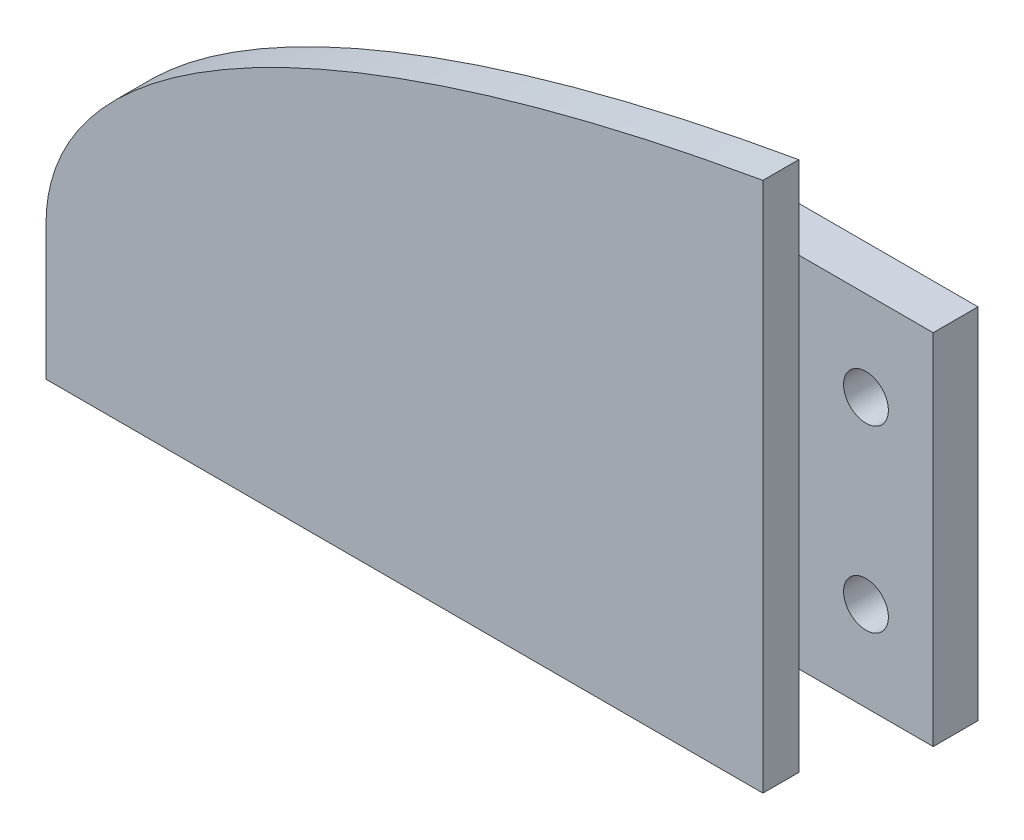
ISO-10303-21;
HEADER;
FILE_DESCRIPTION(('STEP AP214'),'2;1');
FILE_NAME('part.step','',(''),(''),'','','');
FILE_SCHEMA(('AUTOMOTIVE_DESIGN { 1 0 10303 214 1 1 1 1 }'));
ENDSEC;
DATA;
#1=APPLICATION_CONTEXT('core data for automotive mechanical design processes');
#2=APPLICATION_PROTOCOL_DEFINITION('international standard','automotive_design',2000,#1);
#3=PRODUCT_CONTEXT('',#1,'mechanical');
#4=PRODUCT('Part','Part','',(#3));
#5=PRODUCT_RELATED_PRODUCT_CATEGORY('part','',(#4));
#6=PRODUCT_DEFINITION_FORMATION('','',#4);
#7=PRODUCT_DEFINITION_CONTEXT('part definition',#1,'design');
#8=PRODUCT_DEFINITION('design','',#6,#7);
#9=PRODUCT_DEFINITION_SHAPE('','',#8);
#10=(LENGTH_UNIT() NAMED_UNIT(*) SI_UNIT(.MILLI.,.METRE.));
#11=(NAMED_UNIT(*) PLANE_ANGLE_UNIT() SI_UNIT($,.RADIAN.));
#12=(NAMED_UNIT(*) SI_UNIT($,.STERADIAN.) SOLID_ANGLE_UNIT());
#13=UNCERTAINTY_MEASURE_WITH_UNIT(LENGTH_MEASURE(1.E-05),#10,'distance_accuracy_value','');
#14=(GEOMETRIC_REPRESENTATION_CONTEXT(3) GLOBAL_UNCERTAINTY_ASSIGNED_CONTEXT((#13)) GLOBAL_UNIT_ASSIGNED_CONTEXT((#10,
#11,#12)) REPRESENTATION_CONTEXT('',''));
#15=CARTESIAN_POINT('',(0.,0.,0.));
#16=DIRECTION('',(0.,0.,1.));
#17=DIRECTION('',(1.,0.,0.));
#18=AXIS2_PLACEMENT_3D('',#15,#16,#17);
#19=CARTESIAN_POINT('',(0.,0.,0.));
#20=DIRECTION('',(0.,0.,1.));
#21=DIRECTION('',(1.,0.,0.));
#22=AXIS2_PLACEMENT_3D('',#19,#20,#21);
#23=PLANE('',#22);
#24=DIRECTION('',(1.,0.,0.));
#25=VECTOR('',#24,1.);
#26=CARTESIAN_POINT('',(-85.,35.,0.));
#27=LINE('',#26,#25);
#28=CARTESIAN_POINT('',(-85.,35.,0.));
#29=VERTEX_POINT('',#28);
#30=CARTESIAN_POINT('',(-70.,35.,0.));
#31=VERTEX_POINT('',#30);
#32=EDGE_CURVE('E50',#29,#31,#27,.T.);
#33=ORIENTED_EDGE('',*,*,#32,.F.);
#34=DIRECTION('',(0.,1.,0.));
#35=VECTOR('',#34,1.);
#36=CARTESIAN_POINT('',(-85.,-5.,0.));
#37=LINE('',#36,#35);
#38=CARTESIAN_POINT('',(-85.,-5.,0.));
#39=VERTEX_POINT('',#38);
#40=EDGE_CURVE('E195',#39,#29,#37,.T.);
#41=ORIENTED_EDGE('',*,*,#40,.F.);
#42=DIRECTION('',(-1.,0.,0.));
#43=VECTOR('',#42,1.);
#44=CARTESIAN_POINT('',(0.,-5.,0.));
#45=LINE('',#44,#43);
#46=CARTESIAN_POINT('',(-70.,-5.,0.));
#47=VERTEX_POINT('',#46);
#48=EDGE_CURVE('E11',#47,#39,#45,.T.);
#49=ORIENTED_EDGE('',*,*,#48,.F.);
#50=DIRECTION('',(0.,-1.,0.));
#51=VECTOR('',#50,1.);
#52=CARTESIAN_POINT('',(-70.,0.,0.));
#53=LINE('',#52,#51);
#54=CARTESIAN_POINT('',(-70.,-15.,0.));
#55=VERTEX_POINT('',#54);
#56=EDGE_CURVE('E446',#47,#55,#53,.T.);
#57=ORIENTED_EDGE('',*,*,#56,.T.);
#58=DIRECTION('',(1.,0.,0.));
#59=VECTOR('',#58,1.);
#60=CARTESIAN_POINT('',(-150.,-15.,0.));
#61=LINE('',#60,#59);
#62=CARTESIAN_POINT('',(-86.9999999999999,-15.,0.));
#63=VERTEX_POINT('',#62);
#64=EDGE_CURVE('E268',#63,#55,#61,.T.);
#65=ORIENTED_EDGE('',*,*,#64,.F.);
#66=DIRECTION('',(0.,1.,0.));
#67=VECTOR('',#66,1.);
#68=CARTESIAN_POINT('',(-86.9999999999999,-2.51983106480912,0.));
#69=LINE('',#68,#67);
#70=CARTESIAN_POINT('',(-86.9999999999999,-2.51983106480913,0.));
#71=VERTEX_POINT('',#70);
#72=EDGE_CURVE('E285',#63,#71,#69,.T.);
#73=ORIENTED_EDGE('',*,*,#72,.T.);
#74=DIRECTION('',(1.,0.,0.));
#75=VECTOR('',#74,1.);
#76=CARTESIAN_POINT('',(-90.,-2.51983106480913,0.));
#77=LINE('',#76,#75);
#78=CARTESIAN_POINT('',(-112.,-2.51983106480913,0.));
#79=VERTEX_POINT('',#78);
#80=EDGE_CURVE('E241',#79,#71,#77,.T.);
#81=ORIENTED_EDGE('',*,*,#80,.F.);
#82=CARTESIAN_POINT('',(-138.,-2.51983106480913,0.));
#83=VERTEX_POINT('',#82);
#84=EDGE_CURVE('E246',#83,#79,#77,.T.);
#85=ORIENTED_EDGE('',*,*,#84,.F.);
#86=DIRECTION('',(0.,-1.,0.));
#87=VECTOR('',#86,1.);
#88=CARTESIAN_POINT('',(-138.,-15.,0.));
#89=LINE('',#88,#87);
#90=CARTESIAN_POINT('',(-138.,-15.,0.));
#91=VERTEX_POINT('',#90);
#92=EDGE_CURVE('E468',#83,#91,#89,.T.);
#93=ORIENTED_EDGE('',*,*,#92,.T.);
#94=CARTESIAN_POINT('',(-150.,-15.,0.));
#95=VERTEX_POINT('',#94);
#96=EDGE_CURVE('E278',#95,#91,#61,.T.);
#97=ORIENTED_EDGE('',*,*,#96,.F.);
#98=DIRECTION('',(0.,1.,0.));
#99=VECTOR('',#98,1.);
#100=CARTESIAN_POINT('',(-150.,-15.,0.));
#101=LINE('',#100,#99);
#102=CARTESIAN_POINT('',(-150.,0.,0.));
#103=VERTEX_POINT('',#102);
#104=EDGE_CURVE('E512',#95,#103,#101,.T.);
#105=ORIENTED_EDGE('',*,*,#104,.T.);
#106=CARTESIAN_POINT('',(0.,0.,0.));
#107=DIRECTION('',(0.,0.,1.));
#108=DIRECTION('',(1.,0.,0.));
#109=AXIS2_PLACEMENT_3D('',#106,#107,#108);
#110=ELLIPSE('',#109,150.,50.);
#111=CARTESIAN_POINT('',(-70.,44.2216638714053,0.));
#112=VERTEX_POINT('',#111);
#113=EDGE_CURVE('E281',#112,#103,#110,.T.);
#114=ORIENTED_EDGE('',*,*,#113,.F.);
#115=EDGE_CURVE('E445',#112,#31,#53,.T.);
#116=ORIENTED_EDGE('',*,*,#115,.T.);
#117=EDGE_LOOP('',(#33,#41,#49,#57,#65,#73,#81,#85,#93,#97,#105,#114,#116));
#118=FACE_BOUND('',#117,.T.);
#119=ADVANCED_FACE('F35',(#118),#23,.F.);
#120=CARTESIAN_POINT('',(-70.,0.,0.));
#121=DIRECTION('',(-1.,0.,0.));
#122=DIRECTION('',(0.,-1.,0.));
#123=AXIS2_PLACEMENT_3D('',#120,#121,#122);
#124=PLANE('',#123);
#125=DIRECTION('',(0.,0.,-1.));
#126=VECTOR('',#125,1.);
#127=CARTESIAN_POINT('',(-70.,44.2216638714053,4.));
#128=LINE('',#127,#126);
#129=CARTESIAN_POINT('',(-70.,44.2216638714053,4.));
#130=VERTEX_POINT('',#129);
#131=EDGE_CURVE('E448',#130,#112,#128,.T.);
#132=ORIENTED_EDGE('',*,*,#131,.F.);
#133=DIRECTION('',(0.,-1.,0.));
#134=VECTOR('',#133,1.);
#135=CARTESIAN_POINT('',(-70.,0.,4.));
#136=LINE('',#135,#134);
#137=CARTESIAN_POINT('',(-70.,-15.,4.));
#138=VERTEX_POINT('',#137);
#139=EDGE_CURVE('E447',#130,#138,#136,.T.);
#140=ORIENTED_EDGE('',*,*,#139,.T.);
#141=DIRECTION('',(0.,0.,-1.));
#142=VECTOR('',#141,1.);
#143=CARTESIAN_POINT('',(-70.,-15.,0.));
#144=LINE('',#143,#142);
#145=EDGE_CURVE('E43',#138,#55,#144,.T.);
#146=ORIENTED_EDGE('',*,*,#145,.T.);
#147=ORIENTED_EDGE('',*,*,#56,.F.);
#148=EDGE_CURVE('E425',#31,#47,#53,.T.);
#149=ORIENTED_EDGE('',*,*,#148,.F.);
#150=ORIENTED_EDGE('',*,*,#115,.F.);
#151=EDGE_LOOP('',(#132,#140,#146,#147,#149,#150));
#152=FACE_BOUND('',#151,.T.);
#153=ADVANCED_FACE('F37',(#152),#124,.F.);
#154=CARTESIAN_POINT('',(-115.,-2.51983106480913,-10.));
#155=DIRECTION('',(0.,-1.,0.));
#156=DIRECTION('',(0.,0.,-1.));
#157=AXIS2_PLACEMENT_3D('',#154,#155,#156);
#158=PLANE('',#157);
#159=CARTESIAN_POINT('',(-125.,-2.51983106480913,-5.));
#160=DIRECTION('',(0.,1.,0.));
#161=DIRECTION('',(0.,0.,1.));
#162=AXIS2_PLACEMENT_3D('',#159,#160,#161);
#163=CIRCLE('',#162,2.5);
#164=CARTESIAN_POINT('',(-125.,-2.51983106480913,-2.50000000000001));
#165=VERTEX_POINT('',#164);
#166=EDGE_CURVE('E196',#165,#165,#163,.T.);
#167=ORIENTED_EDGE('',*,*,#166,.F.);
#168=EDGE_LOOP('',(#167));
#169=FACE_BOUND('',#168,.T.);
#170=DIRECTION('',(0.707106781186544,0.,-0.707106781186551));
#171=VECTOR('',#170,1.);
#172=CARTESIAN_POINT('',(-121.5,-2.51983106480913,-16.5000000000001));
#173=LINE('',#172,#171);
#174=CARTESIAN_POINT('',(-135.,-2.51983106480913,-3.00000000000003));
#175=VERTEX_POINT('',#174);
#176=EDGE_CURVE('E458',#175,#83,#173,.F.);
#177=ORIENTED_EDGE('',*,*,#176,.T.);
#178=ORIENTED_EDGE('',*,*,#84,.T.);
#179=DIRECTION('',(-0.707106781186544,0.,-0.707106781186551));
#180=VECTOR('',#179,1.);
#181=CARTESIAN_POINT('',(-115.,-2.51983106480913,-3.00000000000004));
#182=LINE('',#181,#180);
#183=CARTESIAN_POINT('',(-112.5,-2.51983106480913,-0.500000000000027));
#184=VERTEX_POINT('',#183);
#185=EDGE_CURVE('E470',#184,#79,#182,.F.);
#186=ORIENTED_EDGE('',*,*,#185,.F.);
#187=DIRECTION('',(0.707106781186544,0.,0.707106781186551));
#188=VECTOR('',#187,1.);
#189=CARTESIAN_POINT('',(-118.5,-2.51983106480913,-6.50000000000006));
#190=LINE('',#189,#188);
#191=CARTESIAN_POINT('',(-115.,-2.51983106480913,-3.00000000000005));
#192=VERTEX_POINT('',#191);
#193=EDGE_CURVE('E461',#184,#192,#190,.F.);
#194=ORIENTED_EDGE('',*,*,#193,.T.);
#195=DIRECTION('',(0.,0.,1.));
#196=VECTOR('',#195,1.);
#197=CARTESIAN_POINT('',(-115.,-2.51983106480913,-10.));
#198=LINE('',#197,#196);
#199=CARTESIAN_POINT('',(-115.,-2.51983106480913,-10.));
#200=VERTEX_POINT('',#199);
#201=EDGE_CURVE('E223',#200,#192,#198,.T.);
#202=ORIENTED_EDGE('',*,*,#201,.F.);
#203=DIRECTION('',(1.,0.,0.));
#204=VECTOR('',#203,1.);
#205=CARTESIAN_POINT('',(-115.,-2.51983106480913,-10.));
#206=LINE('',#205,#204);
#207=CARTESIAN_POINT('',(-135.,-2.51983106480913,-10.));
#208=VERTEX_POINT('',#207);
#209=EDGE_CURVE('E221',#208,#200,#206,.T.);
#210=ORIENTED_EDGE('',*,*,#209,.F.);
#211=DIRECTION('',(0.,0.,1.));
#212=VECTOR('',#211,1.);
#213=CARTESIAN_POINT('',(-135.,-2.51983106480913,-10.));
#214=LINE('',#213,#212);
#215=EDGE_CURVE('E226',#208,#175,#214,.T.);
#216=ORIENTED_EDGE('',*,*,#215,.T.);
#217=EDGE_LOOP('',(#177,#178,#186,#194,#202,#210,#216));
#218=FACE_BOUND('',#217,.T.);
#219=ADVANCED_FACE('F344',(#169,#218),#158,.F.);
#220=CARTESIAN_POINT('',(-90.,-2.51983106480913,-10.));
#221=DIRECTION('',(0.,-1.,0.));
#222=DIRECTION('',(0.,0.,-1.));
#223=AXIS2_PLACEMENT_3D('',#220,#221,#222);
#224=PLANE('',#223);
#225=CARTESIAN_POINT('',(-100.,-2.51983106480913,-5.));
#226=DIRECTION('',(0.,1.,0.));
#227=DIRECTION('',(0.,0.,1.));
#228=AXIS2_PLACEMENT_3D('',#225,#226,#227);
#229=CIRCLE('',#228,2.5);
#230=CARTESIAN_POINT('',(-100.,-2.51983106480913,-2.50000000000001));
#231=VERTEX_POINT('',#230);
#232=EDGE_CURVE('E235',#231,#231,#229,.T.);
#233=ORIENTED_EDGE('',*,*,#232,.F.);
#234=EDGE_LOOP('',(#233));
#235=FACE_BOUND('',#234,.T.);
#236=DIRECTION('',(0.707106781186544,0.,-0.707106781186551));
#237=VECTOR('',#236,1.);
#238=CARTESIAN_POINT('',(-96.5000000000001,-2.51983106480913,-16.5));
#239=LINE('',#238,#237);
#240=CARTESIAN_POINT('',(-110.,-2.51983106480913,-3.00000000000003));
#241=VERTEX_POINT('',#240);
#242=EDGE_CURVE('E481',#241,#184,#239,.F.);
#243=ORIENTED_EDGE('',*,*,#242,.T.);
#244=ORIENTED_EDGE('',*,*,#185,.T.);
#245=ORIENTED_EDGE('',*,*,#80,.T.);
#246=DIRECTION('',(0.707106781186545,0.,0.70710678118655));
#247=VECTOR('',#246,1.);
#248=CARTESIAN_POINT('',(-93.5,-2.51983106480913,-6.50000000000007));
#249=LINE('',#248,#247);
#250=CARTESIAN_POINT('',(-90.,-2.51983106480913,-3.00000000000009));
#251=VERTEX_POINT('',#250);
#252=EDGE_CURVE('E484',#71,#251,#249,.F.);
#253=ORIENTED_EDGE('',*,*,#252,.T.);
#254=DIRECTION('',(0.,0.,1.));
#255=VECTOR('',#254,1.);
#256=CARTESIAN_POINT('',(-90.,-2.51983106480913,-10.));
#257=LINE('',#256,#255);
#258=CARTESIAN_POINT('',(-90.,-2.51983106480913,-10.));
#259=VERTEX_POINT('',#258);
#260=EDGE_CURVE('E252',#259,#251,#257,.T.);
#261=ORIENTED_EDGE('',*,*,#260,.F.);
#262=DIRECTION('',(1.,0.,0.));
#263=VECTOR('',#262,1.);
#264=CARTESIAN_POINT('',(-90.,-2.51983106480913,-10.));
#265=LINE('',#264,#263);
#266=CARTESIAN_POINT('',(-110.,-2.51983106480913,-10.));
#267=VERTEX_POINT('',#266);
#268=EDGE_CURVE('E250',#267,#259,#265,.T.);
#269=ORIENTED_EDGE('',*,*,#268,.F.);
#270=DIRECTION('',(0.,0.,1.));
#271=VECTOR('',#270,1.);
#272=CARTESIAN_POINT('',(-110.,-2.51983106480913,-10.));
#273=LINE('',#272,#271);
#274=EDGE_CURVE('E256',#267,#241,#273,.T.);
#275=ORIENTED_EDGE('',*,*,#274,.T.);
#276=EDGE_LOOP('',(#243,#244,#245,#253,#261,#269,#275));
#277=FACE_BOUND('',#276,.T.);
#278=ADVANCED_FACE('F306',(#235,#277),#224,.F.);
#279=CARTESIAN_POINT('',(0.,0.,4.));
#280=DIRECTION('',(0.,0.,1.));
#281=DIRECTION('',(1.,0.,0.));
#282=AXIS2_PLACEMENT_3D('',#279,#280,#281);
#283=ELLIPSE('',#282,150.,50.);
#284=DIRECTION('',(0.,0.,-1.));
#285=VECTOR('',#284,1.);
#286=SURFACE_OF_LINEAR_EXTRUSION('',#283,#285);
#287=CARTESIAN_POINT('',(-150.,0.,4.));
#288=VERTEX_POINT('',#287);
#289=EDGE_CURVE('E286',#130,#288,#283,.T.);
#290=ORIENTED_EDGE('',*,*,#289,.F.);
#291=ORIENTED_EDGE('',*,*,#131,.T.);
#292=ORIENTED_EDGE('',*,*,#113,.T.);
#293=DIRECTION('',(0.,0.,-1.));
#294=VECTOR('',#293,1.);
#295=CARTESIAN_POINT('',(-150.,0.,4.));
#296=LINE('',#295,#294);
#297=EDGE_CURVE('E296',#103,#288,#296,.F.);
#298=ORIENTED_EDGE('',*,*,#297,.T.);
#299=EDGE_LOOP('',(#290,#291,#292,#298));
#300=FACE_BOUND('',#299,.T.);
#301=ADVANCED_FACE('F301',(#300),#286,.F.);
#302=CARTESIAN_POINT('',(-100.,-22.0710678118655,-5.));
#303=DIRECTION('',(0.,1.,0.));
#304=DIRECTION('',(0.,0.,1.));
#305=AXIS2_PLACEMENT_3D('',#302,#303,#304);
#306=CYLINDRICAL_SURFACE('',#305,2.5);
#307=ORIENTED_EDGE('',*,*,#232,.T.);
#308=EDGE_LOOP('',(#307));
#309=FACE_BOUND('',#308,.T.);
#310=CARTESIAN_POINT('',(-100.,-15.,-5.));
#311=DIRECTION('',(0.,-1.,0.));
#312=DIRECTION('',(0.,0.,-1.));
#313=AXIS2_PLACEMENT_3D('',#310,#311,#312);
#314=CIRCLE('',#313,2.5);
#315=CARTESIAN_POINT('',(-100.,-15.,-7.5));
#316=VERTEX_POINT('',#315);
#317=EDGE_CURVE('E238',#316,#316,#314,.F.);
#318=ORIENTED_EDGE('',*,*,#317,.F.);
#319=EDGE_LOOP('',(#318));
#320=FACE_BOUND('',#319,.T.);
#321=ADVANCED_FACE('F305',(#309,#320),#306,.F.);
#322=CARTESIAN_POINT('',(-125.,-22.0710678118655,-5.));
#323=DIRECTION('',(0.,1.,0.));
#324=DIRECTION('',(0.,0.,1.));
#325=AXIS2_PLACEMENT_3D('',#322,#323,#324);
#326=CYLINDRICAL_SURFACE('',#325,2.5);
#327=ORIENTED_EDGE('',*,*,#166,.T.);
#328=EDGE_LOOP('',(#327));
#329=FACE_BOUND('',#328,.T.);
#330=CARTESIAN_POINT('',(-125.,-15.,-5.));
#331=DIRECTION('',(0.,-1.,0.));
#332=DIRECTION('',(0.,0.,-1.));
#333=AXIS2_PLACEMENT_3D('',#330,#331,#332);
#334=CIRCLE('',#333,2.5);
#335=CARTESIAN_POINT('',(-125.,-15.,-7.5));
#336=VERTEX_POINT('',#335);
#337=EDGE_CURVE('E199',#336,#336,#334,.F.);
#338=ORIENTED_EDGE('',*,*,#337,.F.);
#339=EDGE_LOOP('',(#338));
#340=FACE_BOUND('',#339,.T.);
#341=ADVANCED_FACE('F313',(#329,#340),#326,.F.);
#342=CARTESIAN_POINT('',(-90.,-15.,-3.00000000000009));
#343=DIRECTION('',(0.70710678118655,0.,-0.707106781186545));
#344=DIRECTION('',(0.,1.,0.));
#345=AXIS2_PLACEMENT_3D('',#342,#343,#344);
#346=PLANE('',#345);
#347=ORIENTED_EDGE('',*,*,#252,.F.);
#348=ORIENTED_EDGE('',*,*,#72,.F.);
#349=DIRECTION('',(-0.707106781186545,0.,-0.70710678118655));
#350=VECTOR('',#349,1.);
#351=CARTESIAN_POINT('',(-90.,-15.,-3.00000000000009));
#352=LINE('',#351,#350);
#353=CARTESIAN_POINT('',(-90.,-15.,-3.00000000000009));
#354=VERTEX_POINT('',#353);
#355=EDGE_CURVE('E486',#354,#63,#352,.F.);
#356=ORIENTED_EDGE('',*,*,#355,.F.);
#357=DIRECTION('',(0.,-1.,0.));
#358=VECTOR('',#357,1.);
#359=CARTESIAN_POINT('',(-90.,-15.,-3.00000000000009));
#360=LINE('',#359,#358);
#361=EDGE_CURVE('E283',#251,#354,#360,.T.);
#362=ORIENTED_EDGE('',*,*,#361,.F.);
#363=EDGE_LOOP('',(#347,#348,#356,#362));
#364=FACE_BOUND('',#363,.T.);
#365=ADVANCED_FACE('F309',(#364),#346,.T.);
#366=CARTESIAN_POINT('',(-90.,-15.,-10.));
#367=DIRECTION('',(-1.,0.,0.));
#368=DIRECTION('',(0.,-1.,0.));
#369=AXIS2_PLACEMENT_3D('',#366,#367,#368);
#370=PLANE('',#369);
#371=ORIENTED_EDGE('',*,*,#260,.T.);
#372=ORIENTED_EDGE('',*,*,#361,.T.);
#373=DIRECTION('',(0.,0.,1.));
#374=VECTOR('',#373,1.);
#375=CARTESIAN_POINT('',(-90.,-15.,-10.));
#376=LINE('',#375,#374);
#377=CARTESIAN_POINT('',(-90.,-15.,-10.));
#378=VERTEX_POINT('',#377);
#379=EDGE_CURVE('E262',#378,#354,#376,.T.);
#380=ORIENTED_EDGE('',*,*,#379,.F.);
#381=DIRECTION('',(0.,-1.,0.));
#382=VECTOR('',#381,1.);
#383=CARTESIAN_POINT('',(-90.,-15.,-10.));
#384=LINE('',#383,#382);
#385=EDGE_CURVE('E242',#259,#378,#384,.T.);
#386=ORIENTED_EDGE('',*,*,#385,.F.);
#387=EDGE_LOOP('',(#371,#372,#380,#386));
#388=FACE_BOUND('',#387,.T.);
#389=ADVANCED_FACE('F312',(#388),#370,.F.);
#390=CARTESIAN_POINT('',(-225.,0.,-10.));
#391=DIRECTION('',(0.,0.,1.));
#392=DIRECTION('',(1.,0.,0.));
#393=AXIS2_PLACEMENT_3D('',#390,#391,#392);
#394=PLANE('',#393);
#395=ORIENTED_EDGE('',*,*,#385,.T.);
#396=DIRECTION('',(-1.,0.,0.));
#397=VECTOR('',#396,1.);
#398=CARTESIAN_POINT('',(-90.,-15.,-10.));
#399=LINE('',#398,#397);
#400=CARTESIAN_POINT('',(-110.,-15.,-10.));
#401=VERTEX_POINT('',#400);
#402=EDGE_CURVE('E245',#378,#401,#399,.T.);
#403=ORIENTED_EDGE('',*,*,#402,.T.);
#404=DIRECTION('',(0.,1.,0.));
#405=VECTOR('',#404,1.);
#406=CARTESIAN_POINT('',(-110.,-15.,-10.));
#407=LINE('',#406,#405);
#408=EDGE_CURVE('E248',#401,#267,#407,.T.);
#409=ORIENTED_EDGE('',*,*,#408,.T.);
#410=ORIENTED_EDGE('',*,*,#268,.T.);
#411=EDGE_LOOP('',(#395,#403,#409,#410));
#412=FACE_BOUND('',#411,.T.);
#413=ADVANCED_FACE('F367',(#412),#394,.F.);
#414=CARTESIAN_POINT('',(-110.,-15.,-10.));
#415=DIRECTION('',(1.,0.,0.));
#416=DIRECTION('',(0.,0.,-1.));
#417=AXIS2_PLACEMENT_3D('',#414,#415,#416);
#418=PLANE('',#417);
#419=DIRECTION('',(0.,0.,1.));
#420=VECTOR('',#419,1.);
#421=CARTESIAN_POINT('',(-110.,-15.,-10.));
#422=LINE('',#421,#420);
#423=CARTESIAN_POINT('',(-110.,-15.,-3.00000000000003));
#424=VERTEX_POINT('',#423);
#425=EDGE_CURVE('E259',#401,#424,#422,.T.);
#426=ORIENTED_EDGE('',*,*,#425,.T.);
#427=DIRECTION('',(0.,1.,0.));
#428=VECTOR('',#427,1.);
#429=CARTESIAN_POINT('',(-110.,-2.51983106480913,-3.00000000000003));
#430=LINE('',#429,#428);
#431=EDGE_CURVE('E291',#424,#241,#430,.T.);
#432=ORIENTED_EDGE('',*,*,#431,.T.);
#433=ORIENTED_EDGE('',*,*,#274,.F.);
#434=ORIENTED_EDGE('',*,*,#408,.F.);
#435=EDGE_LOOP('',(#426,#432,#433,#434));
#436=FACE_BOUND('',#435,.T.);
#437=ADVANCED_FACE('F319',(#436),#418,.F.);
#438=CARTESIAN_POINT('',(-110.,-15.,-3.00000000000003));
#439=DIRECTION('',(-0.707106781186551,0.,-0.707106781186544));
#440=DIRECTION('',(0.,-1.,0.));
#441=AXIS2_PLACEMENT_3D('',#438,#439,#440);
#442=PLANE('',#441);
#443=DIRECTION('',(-0.707106781186544,0.,0.707106781186551));
#444=VECTOR('',#443,1.);
#445=CARTESIAN_POINT('',(-110.,-15.,-3.00000000000003));
#446=LINE('',#445,#444);
#447=CARTESIAN_POINT('',(-112.5,-15.,-0.500000000000025));
#448=VERTEX_POINT('',#447);
#449=EDGE_CURVE('E479',#448,#424,#446,.F.);
#450=ORIENTED_EDGE('',*,*,#449,.F.);
#451=DIRECTION('',(0.,1.,0.));
#452=VECTOR('',#451,1.);
#453=CARTESIAN_POINT('',(-112.5,-15.,-0.500000000000036));
#454=LINE('',#453,#452);
#455=EDGE_CURVE('E473',#448,#184,#454,.T.);
#456=ORIENTED_EDGE('',*,*,#455,.T.);
#457=ORIENTED_EDGE('',*,*,#242,.F.);
#458=ORIENTED_EDGE('',*,*,#431,.F.);
#459=EDGE_LOOP('',(#450,#456,#457,#458));
#460=FACE_BOUND('',#459,.T.);
#461=ADVANCED_FACE('F315',(#460),#442,.T.);
#462=CARTESIAN_POINT('',(-115.,-15.,-3.00000000000005));
#463=DIRECTION('',(0.707106781186551,0.,-0.707106781186544));
#464=DIRECTION('',(0.,1.,0.));
#465=AXIS2_PLACEMENT_3D('',#462,#463,#464);
#466=PLANE('',#465);
#467=DIRECTION('',(0.,-1.,0.));
#468=VECTOR('',#467,1.);
#469=CARTESIAN_POINT('',(-115.,-15.,-3.00000000000005));
#470=LINE('',#469,#468);
#471=CARTESIAN_POINT('',(-115.,-15.,-3.00000000000005));
#472=VERTEX_POINT('',#471);
#473=EDGE_CURVE('E476',#192,#472,#470,.T.);
#474=ORIENTED_EDGE('',*,*,#473,.F.);
#475=ORIENTED_EDGE('',*,*,#193,.F.);
#476=ORIENTED_EDGE('',*,*,#455,.F.);
#477=DIRECTION('',(-0.707106781186544,0.,-0.707106781186551));
#478=VECTOR('',#477,1.);
#479=CARTESIAN_POINT('',(-115.,-15.,-3.00000000000005));
#480=LINE('',#479,#478);
#481=EDGE_CURVE('E463',#472,#448,#480,.F.);
#482=ORIENTED_EDGE('',*,*,#481,.F.);
#483=EDGE_LOOP('',(#474,#475,#476,#482));
#484=FACE_BOUND('',#483,.T.);
#485=ADVANCED_FACE('F318',(#484),#466,.T.);
#486=CARTESIAN_POINT('',(-115.,-15.,-10.));
#487=DIRECTION('',(-1.,0.,0.));
#488=DIRECTION('',(0.,-1.,0.));
#489=AXIS2_PLACEMENT_3D('',#486,#487,#488);
#490=PLANE('',#489);
#491=ORIENTED_EDGE('',*,*,#201,.T.);
#492=ORIENTED_EDGE('',*,*,#473,.T.);
#493=DIRECTION('',(0.,0.,1.));
#494=VECTOR('',#493,1.);
#495=CARTESIAN_POINT('',(-115.,-15.,-10.));
#496=LINE('',#495,#494);
#497=CARTESIAN_POINT('',(-115.,-15.,-10.));
#498=VERTEX_POINT('',#497);
#499=EDGE_CURVE('E232',#498,#472,#496,.T.);
#500=ORIENTED_EDGE('',*,*,#499,.F.);
#501=DIRECTION('',(0.,-1.,0.));
#502=VECTOR('',#501,1.);
#503=CARTESIAN_POINT('',(-115.,-15.,-10.));
#504=LINE('',#503,#502);
#505=EDGE_CURVE('E214',#200,#498,#504,.T.);
#506=ORIENTED_EDGE('',*,*,#505,.F.);
#507=EDGE_LOOP('',(#491,#492,#500,#506));
#508=FACE_BOUND('',#507,.T.);
#509=ADVANCED_FACE('F322',(#508),#490,.F.);
#510=CARTESIAN_POINT('',(-250.,0.,-10.));
#511=DIRECTION('',(0.,0.,1.));
#512=DIRECTION('',(1.,0.,0.));
#513=AXIS2_PLACEMENT_3D('',#510,#511,#512);
#514=PLANE('',#513);
#515=ORIENTED_EDGE('',*,*,#505,.T.);
#516=DIRECTION('',(-1.,0.,0.));
#517=VECTOR('',#516,1.);
#518=CARTESIAN_POINT('',(-115.,-15.,-10.));
#519=LINE('',#518,#517);
#520=CARTESIAN_POINT('',(-135.,-15.,-10.));
#521=VERTEX_POINT('',#520);
#522=EDGE_CURVE('E217',#498,#521,#519,.T.);
#523=ORIENTED_EDGE('',*,*,#522,.T.);
#524=DIRECTION('',(0.,1.,0.));
#525=VECTOR('',#524,1.);
#526=CARTESIAN_POINT('',(-135.,-15.,-10.));
#527=LINE('',#526,#525);
#528=EDGE_CURVE('E219',#521,#208,#527,.T.);
#529=ORIENTED_EDGE('',*,*,#528,.T.);
#530=ORIENTED_EDGE('',*,*,#209,.T.);
#531=EDGE_LOOP('',(#515,#523,#529,#530));
#532=FACE_BOUND('',#531,.T.);
#533=ADVANCED_FACE('F336',(#532),#514,.F.);
#534=CARTESIAN_POINT('',(-135.,-15.,-10.));
#535=DIRECTION('',(1.,0.,0.));
#536=DIRECTION('',(0.,0.,-1.));
#537=AXIS2_PLACEMENT_3D('',#534,#535,#536);
#538=PLANE('',#537);
#539=DIRECTION('',(0.,0.,1.));
#540=VECTOR('',#539,1.);
#541=CARTESIAN_POINT('',(-135.,-15.,-10.));
#542=LINE('',#541,#540);
#543=CARTESIAN_POINT('',(-135.,-15.,-3.00000000000003));
#544=VERTEX_POINT('',#543);
#545=EDGE_CURVE('E229',#521,#544,#542,.T.);
#546=ORIENTED_EDGE('',*,*,#545,.T.);
#547=DIRECTION('',(0.,1.,0.));
#548=VECTOR('',#547,1.);
#549=CARTESIAN_POINT('',(-135.,-2.51983106480913,-3.00000000000003));
#550=LINE('',#549,#548);
#551=EDGE_CURVE('E465',#544,#175,#550,.T.);
#552=ORIENTED_EDGE('',*,*,#551,.T.);
#553=ORIENTED_EDGE('',*,*,#215,.F.);
#554=ORIENTED_EDGE('',*,*,#528,.F.);
#555=EDGE_LOOP('',(#546,#552,#553,#554));
#556=FACE_BOUND('',#555,.T.);
#557=ADVANCED_FACE('F327',(#556),#538,.F.);
#558=CARTESIAN_POINT('',(-135.,-15.,-3.00000000000003));
#559=DIRECTION('',(-0.707106781186551,0.,-0.707106781186544));
#560=DIRECTION('',(0.,-1.,0.));
#561=AXIS2_PLACEMENT_3D('',#558,#559,#560);
#562=PLANE('',#561);
#563=DIRECTION('',(-0.707106781186544,0.,0.707106781186551));
#564=VECTOR('',#563,1.);
#565=CARTESIAN_POINT('',(-135.,-15.,-3.00000000000003));
#566=LINE('',#565,#564);
#567=EDGE_CURVE('E452',#91,#544,#566,.F.);
#568=ORIENTED_EDGE('',*,*,#567,.F.);
#569=ORIENTED_EDGE('',*,*,#92,.F.);
#570=ORIENTED_EDGE('',*,*,#176,.F.);
#571=ORIENTED_EDGE('',*,*,#551,.F.);
#572=EDGE_LOOP('',(#568,#569,#570,#571));
#573=FACE_BOUND('',#572,.T.);
#574=ADVANCED_FACE('F324',(#573),#562,.T.);
#575=CARTESIAN_POINT('',(-150.,-15.,4.));
#576=DIRECTION('',(1.,0.,0.));
#577=DIRECTION('',(0.,0.,-1.));
#578=AXIS2_PLACEMENT_3D('',#575,#576,#577);
#579=PLANE('',#578);
#580=ORIENTED_EDGE('',*,*,#297,.F.);
#581=ORIENTED_EDGE('',*,*,#104,.F.);
#582=DIRECTION('',(0.,0.,-1.));
#583=VECTOR('',#582,1.);
#584=CARTESIAN_POINT('',(-150.,-15.,4.));
#585=LINE('',#584,#583);
#586=CARTESIAN_POINT('',(-150.,-15.,4.));
#587=VERTEX_POINT('',#586);
#588=EDGE_CURVE('E265',#587,#95,#585,.T.);
#589=ORIENTED_EDGE('',*,*,#588,.F.);
#590=DIRECTION('',(0.,1.,0.));
#591=VECTOR('',#590,1.);
#592=CARTESIAN_POINT('',(-150.,-15.,4.));
#593=LINE('',#592,#591);
#594=EDGE_CURVE('E510',#587,#288,#593,.T.);
#595=ORIENTED_EDGE('',*,*,#594,.T.);
#596=EDGE_LOOP('',(#580,#581,#589,#595));
#597=FACE_BOUND('',#596,.T.);
#598=ADVANCED_FACE('F326',(#597),#579,.F.);
#599=CARTESIAN_POINT('',(0.,0.,4.));
#600=DIRECTION('',(0.,0.,1.));
#601=DIRECTION('',(1.,0.,0.));
#602=AXIS2_PLACEMENT_3D('',#599,#600,#601);
#603=PLANE('',#602);
#604=ORIENTED_EDGE('',*,*,#139,.F.);
#605=ORIENTED_EDGE('',*,*,#289,.T.);
#606=ORIENTED_EDGE('',*,*,#594,.F.);
#607=DIRECTION('',(-1.,0.,0.));
#608=VECTOR('',#607,1.);
#609=CARTESIAN_POINT('',(-150.,-15.,4.));
#610=LINE('',#609,#608);
#611=EDGE_CURVE('E271',#138,#587,#610,.T.);
#612=ORIENTED_EDGE('',*,*,#611,.F.);
#613=EDGE_LOOP('',(#604,#605,#606,#612));
#614=FACE_BOUND('',#613,.T.);
#615=ADVANCED_FACE('F333',(#614),#603,.T.);
#616=CARTESIAN_POINT('',(0.,-15.,0.));
#617=DIRECTION('',(0.,-1.,0.));
#618=DIRECTION('',(0.,0.,-1.));
#619=AXIS2_PLACEMENT_3D('',#616,#617,#618);
#620=PLANE('',#619);
#621=ORIENTED_EDGE('',*,*,#145,.F.);
#622=ORIENTED_EDGE('',*,*,#611,.T.);
#623=ORIENTED_EDGE('',*,*,#588,.T.);
#624=ORIENTED_EDGE('',*,*,#96,.T.);
#625=ORIENTED_EDGE('',*,*,#567,.T.);
#626=ORIENTED_EDGE('',*,*,#545,.F.);
#627=ORIENTED_EDGE('',*,*,#522,.F.);
#628=ORIENTED_EDGE('',*,*,#499,.T.);
#629=ORIENTED_EDGE('',*,*,#481,.T.);
#630=ORIENTED_EDGE('',*,*,#449,.T.);
#631=ORIENTED_EDGE('',*,*,#425,.F.);
#632=ORIENTED_EDGE('',*,*,#402,.F.);
#633=ORIENTED_EDGE('',*,*,#379,.T.);
#634=ORIENTED_EDGE('',*,*,#355,.T.);
#635=ORIENTED_EDGE('',*,*,#64,.T.);
#636=EDGE_LOOP('',(#621,#622,#623,#624,#625,#626,#627,#628,#629,#630,#631,#632,#633,#634,#635));
#637=FACE_BOUND('',#636,.T.);
#638=ORIENTED_EDGE('',*,*,#337,.T.);
#639=EDGE_LOOP('',(#638));
#640=FACE_BOUND('',#639,.T.);
#641=ORIENTED_EDGE('',*,*,#317,.T.);
#642=EDGE_LOOP('',(#641));
#643=FACE_BOUND('',#642,.T.);
#644=ADVANCED_FACE('F346',(#637,#640,#643),#620,.T.);
#645=CARTESIAN_POINT('',(0.,0.,0.));
#646=DIRECTION('',(0.,0.,-1.));
#647=DIRECTION('',(-1.,0.,0.));
#648=AXIS2_PLACEMENT_3D('',#645,#646,#647);
#649=PLANE('',#648);
#650=CARTESIAN_POINT('',(-62.5,25.,0.));
#651=DIRECTION('',(0.,0.,-1.));
#652=DIRECTION('',(-1.,0.,0.));
#653=AXIS2_PLACEMENT_3D('',#650,#651,#652);
#654=CIRCLE('',#653,2.5);
#655=CARTESIAN_POINT('',(-65.,25.,0.));
#656=VERTEX_POINT('',#655);
#657=EDGE_CURVE('E208',#656,#656,#654,.T.);
#658=ORIENTED_EDGE('',*,*,#657,.T.);
#659=EDGE_LOOP('',(#658));
#660=FACE_BOUND('',#659,.T.);
#661=CARTESIAN_POINT('',(-62.5,5.,0.));
#662=DIRECTION('',(0.,0.,-1.));
#663=DIRECTION('',(-1.,0.,0.));
#664=AXIS2_PLACEMENT_3D('',#661,#662,#663);
#665=CIRCLE('',#664,2.5);
#666=CARTESIAN_POINT('',(-65.,5.,0.));
#667=VERTEX_POINT('',#666);
#668=EDGE_CURVE('E205',#667,#667,#665,.T.);
#669=ORIENTED_EDGE('',*,*,#668,.T.);
#670=EDGE_LOOP('',(#669));
#671=FACE_BOUND('',#670,.T.);
#672=CARTESIAN_POINT('',(-55.,35.,0.));
#673=VERTEX_POINT('',#672);
#674=EDGE_CURVE('E423',#31,#673,#27,.T.);
#675=ORIENTED_EDGE('',*,*,#674,.F.);
#676=ORIENTED_EDGE('',*,*,#148,.T.);
#677=DIRECTION('',(-1.,0.,0.));
#678=VECTOR('',#677,1.);
#679=CARTESIAN_POINT('',(-85.,-5.,0.));
#680=LINE('',#679,#678);
#681=CARTESIAN_POINT('',(-55.,-5.,0.));
#682=VERTEX_POINT('',#681);
#683=EDGE_CURVE('E192',#682,#47,#680,.T.);
#684=ORIENTED_EDGE('',*,*,#683,.F.);
#685=DIRECTION('',(0.,-1.,0.));
#686=VECTOR('',#685,1.);
#687=CARTESIAN_POINT('',(-55.,-5.,0.));
#688=LINE('',#687,#686);
#689=EDGE_CURVE('E427',#673,#682,#688,.T.);
#690=ORIENTED_EDGE('',*,*,#689,.F.);
#691=EDGE_LOOP('',(#675,#676,#684,#690));
#692=FACE_BOUND('',#691,.T.);
#693=ADVANCED_FACE('F352',(#660,#671,#692),#649,.F.);
#694=CARTESIAN_POINT('',(-85.,-5.,-5.));
#695=DIRECTION('',(1.,0.,0.));
#696=DIRECTION('',(0.,0.,-1.));
#697=AXIS2_PLACEMENT_3D('',#694,#695,#696);
#698=PLANE('',#697);
#699=ORIENTED_EDGE('',*,*,#40,.T.);
#700=DIRECTION('',(0.,0.,1.));
#701=VECTOR('',#700,1.);
#702=CARTESIAN_POINT('',(-85.,35.,-5.));
#703=LINE('',#702,#701);
#704=CARTESIAN_POINT('',(-85.,35.,-5.));
#705=VERTEX_POINT('',#704);
#706=EDGE_CURVE('E176',#705,#29,#703,.T.);
#707=ORIENTED_EDGE('',*,*,#706,.F.);
#708=DIRECTION('',(0.,1.,0.));
#709=VECTOR('',#708,1.);
#710=CARTESIAN_POINT('',(-85.,-5.,-5.));
#711=LINE('',#710,#709);
#712=CARTESIAN_POINT('',(-85.,-5.,-5.));
#713=VERTEX_POINT('',#712);
#714=EDGE_CURVE('E183',#713,#705,#711,.T.);
#715=ORIENTED_EDGE('',*,*,#714,.F.);
#716=DIRECTION('',(0.,0.,1.));
#717=VECTOR('',#716,1.);
#718=CARTESIAN_POINT('',(-85.,-5.,-5.));
#719=LINE('',#718,#717);
#720=EDGE_CURVE('E434',#713,#39,#719,.T.);
#721=ORIENTED_EDGE('',*,*,#720,.T.);
#722=EDGE_LOOP('',(#699,#707,#715,#721));
#723=FACE_BOUND('',#722,.T.);
#724=ADVANCED_FACE('F194',(#723),#698,.F.);
#725=CARTESIAN_POINT('',(-85.,35.,-5.));
#726=DIRECTION('',(0.,-1.,0.));
#727=DIRECTION('',(1.,0.,0.));
#728=AXIS2_PLACEMENT_3D('',#725,#726,#727);
#729=PLANE('',#728);
#730=ORIENTED_EDGE('',*,*,#32,.T.);
#731=ORIENTED_EDGE('',*,*,#674,.T.);
#732=DIRECTION('',(0.,0.,1.));
#733=VECTOR('',#732,1.);
#734=CARTESIAN_POINT('',(-55.,35.,-5.));
#735=LINE('',#734,#733);
#736=CARTESIAN_POINT('',(-55.,35.,-5.));
#737=VERTEX_POINT('',#736);
#738=EDGE_CURVE('E179',#737,#673,#735,.T.);
#739=ORIENTED_EDGE('',*,*,#738,.F.);
#740=DIRECTION('',(1.,0.,0.));
#741=VECTOR('',#740,1.);
#742=CARTESIAN_POINT('',(-85.,35.,-5.));
#743=LINE('',#742,#741);
#744=EDGE_CURVE('E172',#705,#737,#743,.T.);
#745=ORIENTED_EDGE('',*,*,#744,.F.);
#746=ORIENTED_EDGE('',*,*,#706,.T.);
#747=EDGE_LOOP('',(#730,#731,#739,#745,#746));
#748=FACE_BOUND('',#747,.T.);
#749=ADVANCED_FACE('F174',(#748),#729,.F.);
#750=CARTESIAN_POINT('',(-55.,-5.,-5.));
#751=DIRECTION('',(-1.,0.,0.));
#752=DIRECTION('',(0.,0.,1.));
#753=AXIS2_PLACEMENT_3D('',#750,#751,#752);
#754=PLANE('',#753);
#755=ORIENTED_EDGE('',*,*,#689,.T.);
#756=DIRECTION('',(0.,0.,1.));
#757=VECTOR('',#756,1.);
#758=CARTESIAN_POINT('',(-55.,-5.,-5.));
#759=LINE('',#758,#757);
#760=CARTESIAN_POINT('',(-55.,-5.,-5.));
#761=VERTEX_POINT('',#760);
#762=EDGE_CURVE('E201',#761,#682,#759,.T.);
#763=ORIENTED_EDGE('',*,*,#762,.F.);
#764=DIRECTION('',(0.,-1.,0.));
#765=VECTOR('',#764,1.);
#766=CARTESIAN_POINT('',(-55.,-5.,-5.));
#767=LINE('',#766,#765);
#768=EDGE_CURVE('E182',#737,#761,#767,.T.);
#769=ORIENTED_EDGE('',*,*,#768,.F.);
#770=ORIENTED_EDGE('',*,*,#738,.T.);
#771=EDGE_LOOP('',(#755,#763,#769,#770));
#772=FACE_BOUND('',#771,.T.);
#773=ADVANCED_FACE('F393',(#772),#754,.F.);
#774=CARTESIAN_POINT('',(-85.,-5.,-5.));
#775=DIRECTION('',(0.,1.,0.));
#776=DIRECTION('',(0.,0.,1.));
#777=AXIS2_PLACEMENT_3D('',#774,#775,#776);
#778=PLANE('',#777);
#779=ORIENTED_EDGE('',*,*,#683,.T.);
#780=ORIENTED_EDGE('',*,*,#48,.T.);
#781=ORIENTED_EDGE('',*,*,#720,.F.);
#782=DIRECTION('',(-1.,0.,0.));
#783=VECTOR('',#782,1.);
#784=CARTESIAN_POINT('',(-85.,-5.,-5.));
#785=LINE('',#784,#783);
#786=EDGE_CURVE('E188',#761,#713,#785,.T.);
#787=ORIENTED_EDGE('',*,*,#786,.F.);
#788=ORIENTED_EDGE('',*,*,#762,.T.);
#789=EDGE_LOOP('',(#779,#780,#781,#787,#788));
#790=FACE_BOUND('',#789,.T.);
#791=ADVANCED_FACE('F396',(#790),#778,.F.);
#792=CARTESIAN_POINT('',(0.,0.,-5.));
#793=DIRECTION('',(0.,0.,-1.));
#794=DIRECTION('',(-1.,0.,0.));
#795=AXIS2_PLACEMENT_3D('',#792,#793,#794);
#796=PLANE('',#795);
#797=CARTESIAN_POINT('',(-62.5,25.,-5.));
#798=DIRECTION('',(0.,0.,-1.));
#799=DIRECTION('',(-1.,0.,0.));
#800=AXIS2_PLACEMENT_3D('',#797,#798,#799);
#801=CIRCLE('',#800,2.5);
#802=CARTESIAN_POINT('',(-65.,25.,-5.));
#803=VERTEX_POINT('',#802);
#804=EDGE_CURVE('E209',#803,#803,#801,.T.);
#805=ORIENTED_EDGE('',*,*,#804,.F.);
#806=EDGE_LOOP('',(#805));
#807=FACE_BOUND('',#806,.T.);
#808=CARTESIAN_POINT('',(-62.5,5.,-5.));
#809=DIRECTION('',(0.,0.,-1.));
#810=DIRECTION('',(-1.,0.,0.));
#811=AXIS2_PLACEMENT_3D('',#808,#809,#810);
#812=CIRCLE('',#811,2.5);
#813=CARTESIAN_POINT('',(-65.,5.,-5.));
#814=VERTEX_POINT('',#813);
#815=EDGE_CURVE('E439',#814,#814,#812,.T.);
#816=ORIENTED_EDGE('',*,*,#815,.F.);
#817=EDGE_LOOP('',(#816));
#818=FACE_BOUND('',#817,.T.);
#819=ORIENTED_EDGE('',*,*,#714,.T.);
#820=ORIENTED_EDGE('',*,*,#744,.T.);
#821=ORIENTED_EDGE('',*,*,#768,.T.);
#822=ORIENTED_EDGE('',*,*,#786,.T.);
#823=EDGE_LOOP('',(#819,#820,#821,#822));
#824=FACE_BOUND('',#823,.T.);
#825=ADVANCED_FACE('F186',(#807,#818,#824),#796,.T.);
#826=CARTESIAN_POINT('',(-62.5,5.,11.0710678118655));
#827=DIRECTION('',(0.,0.,-1.));
#828=DIRECTION('',(-1.,0.,0.));
#829=AXIS2_PLACEMENT_3D('',#826,#827,#828);
#830=CYLINDRICAL_SURFACE('',#829,2.5);
#831=ORIENTED_EDGE('',*,*,#815,.T.);
#832=EDGE_LOOP('',(#831));
#833=FACE_BOUND('',#832,.T.);
#834=ORIENTED_EDGE('',*,*,#668,.F.);
#835=EDGE_LOOP('',(#834));
#836=FACE_BOUND('',#835,.T.);
#837=ADVANCED_FACE('F403',(#833,#836),#830,.F.);
#838=CARTESIAN_POINT('',(-62.5,25.,11.0710678118655));
#839=DIRECTION('',(0.,0.,-1.));
#840=DIRECTION('',(-1.,0.,0.));
#841=AXIS2_PLACEMENT_3D('',#838,#839,#840);
#842=CYLINDRICAL_SURFACE('',#841,2.5);
#843=ORIENTED_EDGE('',*,*,#804,.T.);
#844=EDGE_LOOP('',(#843));
#845=FACE_BOUND('',#844,.T.);
#846=ORIENTED_EDGE('',*,*,#657,.F.);
#847=EDGE_LOOP('',(#846));
#848=FACE_BOUND('',#847,.T.);
#849=ADVANCED_FACE('F407',(#845,#848),#842,.F.);
#850=CLOSED_SHELL('',(#119,#153,#219,#278,#301,#321,#341,#365,#389,#413,#437,#461,#485,#509,
#533,#557,#574,#598,#615,#644,#693,#724,#749,#773,#791,#825,#837,#849));
#851=MANIFOLD_SOLID_BREP('B2',#850);
#852=ADVANCED_BREP_SHAPE_REPRESENTATION('',(#18,#851),#14);
#853=SHAPE_DEFINITION_REPRESENTATION(#9,#852);
ENDSEC;
END-ISO-10303-21;
